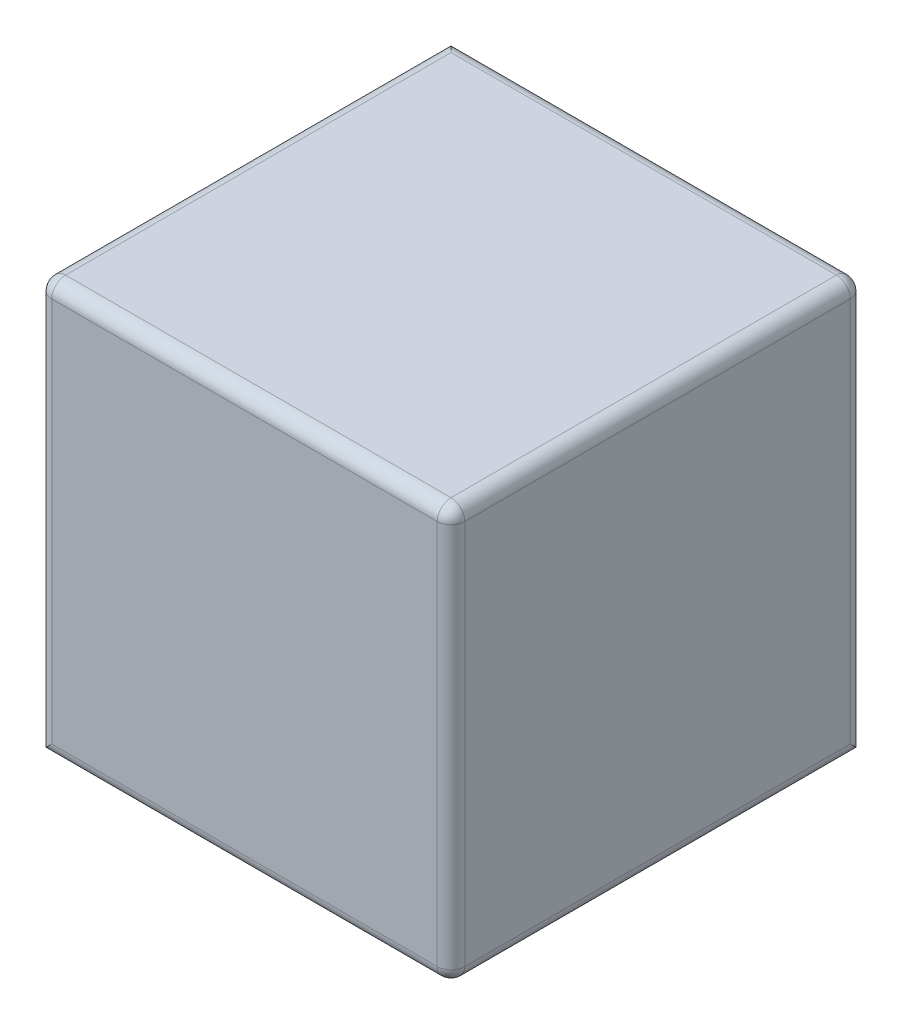
ISO-10303-21;
HEADER;
FILE_DESCRIPTION(('STEP AP214'),'2;1');
FILE_NAME('part.step','',(''),(''),'','','');
FILE_SCHEMA(('AUTOMOTIVE_DESIGN { 1 0 10303 214 1 1 1 1 }'));
ENDSEC;
DATA;
#1=APPLICATION_CONTEXT('core data for automotive mechanical design processes');
#2=APPLICATION_PROTOCOL_DEFINITION('international standard','automotive_design',2000,#1);
#3=PRODUCT_CONTEXT('',#1,'mechanical');
#4=PRODUCT('Part','Part','',(#3));
#5=PRODUCT_RELATED_PRODUCT_CATEGORY('part','',(#4));
#6=PRODUCT_DEFINITION_FORMATION('','',#4);
#7=PRODUCT_DEFINITION_CONTEXT('part definition',#1,'design');
#8=PRODUCT_DEFINITION('design','',#6,#7);
#9=PRODUCT_DEFINITION_SHAPE('','',#8);
#10=(LENGTH_UNIT() NAMED_UNIT(*) SI_UNIT(.MILLI.,.METRE.));
#11=(NAMED_UNIT(*) PLANE_ANGLE_UNIT() SI_UNIT($,.RADIAN.));
#12=(NAMED_UNIT(*) SI_UNIT($,.STERADIAN.) SOLID_ANGLE_UNIT());
#13=UNCERTAINTY_MEASURE_WITH_UNIT(LENGTH_MEASURE(1.E-05),#10,'distance_accuracy_value','');
#14=(GEOMETRIC_REPRESENTATION_CONTEXT(3) GLOBAL_UNCERTAINTY_ASSIGNED_CONTEXT((#13)) GLOBAL_UNIT_ASSIGNED_CONTEXT((#10,
#11,#12)) REPRESENTATION_CONTEXT('',''));
#15=CARTESIAN_POINT('',(0.,0.,0.));
#16=DIRECTION('',(0.,0.,1.));
#17=DIRECTION('',(1.,0.,0.));
#18=AXIS2_PLACEMENT_3D('',#15,#16,#17);
#19=CARTESIAN_POINT('',(150.,-150.,300.));
#20=DIRECTION('',(-1.,0.,0.));
#21=DIRECTION('',(0.,0.,1.));
#22=AXIS2_PLACEMENT_3D('',#19,#20,#21);
#23=PLANE('',#22);
#24=DIRECTION('',(0.,1.,0.));
#25=VECTOR('',#24,1.);
#26=CARTESIAN_POINT('',(150.,-150.,290.));
#27=LINE('',#26,#25);
#28=CARTESIAN_POINT('',(150.,140.,290.));
#29=VERTEX_POINT('',#28);
#30=CARTESIAN_POINT('',(150.,-140.,290.));
#31=VERTEX_POINT('',#30);
#32=EDGE_CURVE('E139',#29,#31,#27,.F.);
#33=ORIENTED_EDGE('',*,*,#32,.T.);
#34=DIRECTION('',(0.,0.,-1.));
#35=VECTOR('',#34,1.);
#36=CARTESIAN_POINT('',(150.,-140.,300.));
#37=LINE('',#36,#35);
#38=CARTESIAN_POINT('',(150.,-140.,10.));
#39=VERTEX_POINT('',#38);
#40=EDGE_CURVE('E146',#31,#39,#37,.T.);
#41=ORIENTED_EDGE('',*,*,#40,.T.);
#42=DIRECTION('',(0.,1.,0.));
#43=VECTOR('',#42,1.);
#44=CARTESIAN_POINT('',(150.,150.,10.));
#45=LINE('',#44,#43);
#46=CARTESIAN_POINT('',(150.,140.,10.));
#47=VERTEX_POINT('',#46);
#48=EDGE_CURVE('E142',#39,#47,#45,.T.);
#49=ORIENTED_EDGE('',*,*,#48,.T.);
#50=DIRECTION('',(0.,0.,-1.));
#51=VECTOR('',#50,1.);
#52=CARTESIAN_POINT('',(150.,140.,300.));
#53=LINE('',#52,#51);
#54=EDGE_CURVE('E119',#47,#29,#53,.F.);
#55=ORIENTED_EDGE('',*,*,#54,.T.);
#56=EDGE_LOOP('',(#33,#41,#49,#55));
#57=FACE_BOUND('',#56,.T.);
#58=ADVANCED_FACE('F39',(#57),#23,.F.);
#59=CARTESIAN_POINT('',(-150.,150.,300.));
#60=DIRECTION('',(0.,-1.,0.));
#61=DIRECTION('',(0.,0.,-1.));
#62=AXIS2_PLACEMENT_3D('',#59,#60,#61);
#63=PLANE('',#62);
#64=DIRECTION('',(-1.,0.,0.));
#65=VECTOR('',#64,1.);
#66=CARTESIAN_POINT('',(-150.,150.,10.));
#67=LINE('',#66,#65);
#68=CARTESIAN_POINT('',(140.,150.,10.));
#69=VERTEX_POINT('',#68);
#70=CARTESIAN_POINT('',(-140.,150.,10.));
#71=VERTEX_POINT('',#70);
#72=EDGE_CURVE('E160',#69,#71,#67,.T.);
#73=ORIENTED_EDGE('',*,*,#72,.T.);
#74=DIRECTION('',(0.,0.,-1.));
#75=VECTOR('',#74,1.);
#76=CARTESIAN_POINT('',(-140.,150.,300.));
#77=LINE('',#76,#75);
#78=CARTESIAN_POINT('',(-140.,150.,290.));
#79=VERTEX_POINT('',#78);
#80=EDGE_CURVE('E164',#71,#79,#77,.F.);
#81=ORIENTED_EDGE('',*,*,#80,.T.);
#82=DIRECTION('',(-1.,0.,0.));
#83=VECTOR('',#82,1.);
#84=CARTESIAN_POINT('',(-150.,150.,290.));
#85=LINE('',#84,#83);
#86=CARTESIAN_POINT('',(140.,150.,290.));
#87=VERTEX_POINT('',#86);
#88=EDGE_CURVE('E157',#79,#87,#85,.F.);
#89=ORIENTED_EDGE('',*,*,#88,.T.);
#90=DIRECTION('',(0.,0.,-1.));
#91=VECTOR('',#90,1.);
#92=CARTESIAN_POINT('',(140.,150.,300.));
#93=LINE('',#92,#91);
#94=EDGE_CURVE('E154',#87,#69,#93,.T.);
#95=ORIENTED_EDGE('',*,*,#94,.T.);
#96=EDGE_LOOP('',(#73,#81,#89,#95));
#97=FACE_BOUND('',#96,.T.);
#98=ADVANCED_FACE('F291',(#97),#63,.F.);
#99=CARTESIAN_POINT('',(-150.,-150.,300.));
#100=DIRECTION('',(1.,0.,0.));
#101=DIRECTION('',(0.,0.,-1.));
#102=AXIS2_PLACEMENT_3D('',#99,#100,#101);
#103=PLANE('',#102);
#104=DIRECTION('',(0.,0.,-1.));
#105=VECTOR('',#104,1.);
#106=CARTESIAN_POINT('',(-150.,-150.,300.));
#107=LINE('',#106,#105);
#108=CARTESIAN_POINT('',(-150.,-150.,290.));
#109=VERTEX_POINT('',#108);
#110=CARTESIAN_POINT('',(-150.,-150.,0.));
#111=VERTEX_POINT('',#110);
#112=EDGE_CURVE('E113',#109,#111,#107,.T.);
#113=ORIENTED_EDGE('',*,*,#112,.F.);
#114=DIRECTION('',(0.,-1.,0.));
#115=VECTOR('',#114,1.);
#116=CARTESIAN_POINT('',(-150.,-150.,290.));
#117=LINE('',#116,#115);
#118=CARTESIAN_POINT('',(-150.,140.,290.));
#119=VERTEX_POINT('',#118);
#120=EDGE_CURVE('E63',#109,#119,#117,.F.);
#121=ORIENTED_EDGE('',*,*,#120,.T.);
#122=DIRECTION('',(0.,0.,-1.));
#123=VECTOR('',#122,1.);
#124=CARTESIAN_POINT('',(-150.,140.,300.));
#125=LINE('',#124,#123);
#126=CARTESIAN_POINT('',(-150.,140.,0.));
#127=VERTEX_POINT('',#126);
#128=EDGE_CURVE('E125',#119,#127,#125,.T.);
#129=ORIENTED_EDGE('',*,*,#128,.T.);
#130=DIRECTION('',(0.,-1.,0.));
#131=VECTOR('',#130,1.);
#132=CARTESIAN_POINT('',(-150.,-150.,0.));
#133=LINE('',#132,#131);
#134=EDGE_CURVE('E122',#127,#111,#133,.T.);
#135=ORIENTED_EDGE('',*,*,#134,.T.);
#136=EDGE_LOOP('',(#113,#121,#129,#135));
#137=FACE_BOUND('',#136,.T.);
#138=ADVANCED_FACE('F123',(#137),#103,.F.);
#139=CARTESIAN_POINT('',(-150.,-150.,300.));
#140=DIRECTION('',(0.,1.,0.));
#141=DIRECTION('',(0.,0.,1.));
#142=AXIS2_PLACEMENT_3D('',#139,#140,#141);
#143=PLANE('',#142);
#144=DIRECTION('',(0.,0.,-1.));
#145=VECTOR('',#144,1.);
#146=CARTESIAN_POINT('',(140.,-150.,300.));
#147=LINE('',#146,#145);
#148=CARTESIAN_POINT('',(140.,-150.,0.));
#149=VERTEX_POINT('',#148);
#150=CARTESIAN_POINT('',(140.,-150.,290.));
#151=VERTEX_POINT('',#150);
#152=EDGE_CURVE('E49',#149,#151,#147,.F.);
#153=ORIENTED_EDGE('',*,*,#152,.T.);
#154=DIRECTION('',(1.,0.,0.));
#155=VECTOR('',#154,1.);
#156=CARTESIAN_POINT('',(-150.,-150.,290.));
#157=LINE('',#156,#155);
#158=EDGE_CURVE('E11',#151,#109,#157,.F.);
#159=ORIENTED_EDGE('',*,*,#158,.T.);
#160=ORIENTED_EDGE('',*,*,#112,.T.);
#161=DIRECTION('',(1.,0.,0.));
#162=VECTOR('',#161,1.);
#163=CARTESIAN_POINT('',(-150.,-150.,0.));
#164=LINE('',#163,#162);
#165=EDGE_CURVE('E117',#111,#149,#164,.T.);
#166=ORIENTED_EDGE('',*,*,#165,.T.);
#167=EDGE_LOOP('',(#153,#159,#160,#166));
#168=FACE_BOUND('',#167,.T.);
#169=ADVANCED_FACE('F115',(#168),#143,.F.);
#170=CARTESIAN_POINT('',(0.,0.,300.));
#171=DIRECTION('',(0.,0.,-1.));
#172=DIRECTION('',(-1.,0.,0.));
#173=AXIS2_PLACEMENT_3D('',#170,#171,#172);
#174=PLANE('',#173);
#175=DIRECTION('',(1.,0.,0.));
#176=VECTOR('',#175,1.);
#177=CARTESIAN_POINT('',(0.,-140.,300.));
#178=LINE('',#177,#176);
#179=CARTESIAN_POINT('',(-140.,-140.,300.));
#180=VERTEX_POINT('',#179);
#181=CARTESIAN_POINT('',(140.,-140.,300.));
#182=VERTEX_POINT('',#181);
#183=EDGE_CURVE('E167',#180,#182,#178,.T.);
#184=ORIENTED_EDGE('',*,*,#183,.T.);
#185=DIRECTION('',(0.,1.,0.));
#186=VECTOR('',#185,1.);
#187=CARTESIAN_POINT('',(140.,0.,300.));
#188=LINE('',#187,#186);
#189=CARTESIAN_POINT('',(140.,140.,300.));
#190=VERTEX_POINT('',#189);
#191=EDGE_CURVE('E176',#182,#190,#188,.T.);
#192=ORIENTED_EDGE('',*,*,#191,.T.);
#193=DIRECTION('',(-1.,0.,0.));
#194=VECTOR('',#193,1.);
#195=CARTESIAN_POINT('',(0.,140.,300.));
#196=LINE('',#195,#194);
#197=CARTESIAN_POINT('',(-140.,140.,300.));
#198=VERTEX_POINT('',#197);
#199=EDGE_CURVE('E173',#190,#198,#196,.T.);
#200=ORIENTED_EDGE('',*,*,#199,.T.);
#201=DIRECTION('',(0.,-1.,0.));
#202=VECTOR('',#201,1.);
#203=CARTESIAN_POINT('',(-140.,0.,300.));
#204=LINE('',#203,#202);
#205=EDGE_CURVE('E170',#198,#180,#204,.T.);
#206=ORIENTED_EDGE('',*,*,#205,.T.);
#207=EDGE_LOOP('',(#184,#192,#200,#206));
#208=FACE_BOUND('',#207,.T.);
#209=ADVANCED_FACE('F283',(#208),#174,.F.);
#210=CARTESIAN_POINT('',(0.,0.,0.));
#211=DIRECTION('',(0.,0.,-1.));
#212=DIRECTION('',(-1.,0.,0.));
#213=AXIS2_PLACEMENT_3D('',#210,#211,#212);
#214=PLANE('',#213);
#215=DIRECTION('',(-1.,0.,0.));
#216=VECTOR('',#215,1.);
#217=CARTESIAN_POINT('',(150.,140.,0.));
#218=LINE('',#217,#216);
#219=CARTESIAN_POINT('',(140.,140.,0.));
#220=VERTEX_POINT('',#219);
#221=EDGE_CURVE('E149',#127,#220,#218,.F.);
#222=ORIENTED_EDGE('',*,*,#221,.T.);
#223=DIRECTION('',(0.,1.,0.));
#224=VECTOR('',#223,1.);
#225=CARTESIAN_POINT('',(140.,-150.,0.));
#226=LINE('',#225,#224);
#227=EDGE_CURVE('E133',#220,#149,#226,.F.);
#228=ORIENTED_EDGE('',*,*,#227,.T.);
#229=ORIENTED_EDGE('',*,*,#165,.F.);
#230=ORIENTED_EDGE('',*,*,#134,.F.);
#231=EDGE_LOOP('',(#222,#228,#229,#230));
#232=FACE_BOUND('',#231,.T.);
#233=ADVANCED_FACE('F131',(#232),#214,.T.);
#234=CARTESIAN_POINT('',(-140.,0.,290.));
#235=DIRECTION('',(0.,-1.,0.));
#236=DIRECTION('',(0.,0.,-1.));
#237=AXIS2_PLACEMENT_3D('',#234,#235,#236);
#238=CYLINDRICAL_SURFACE('',#237,10.);
#239=CARTESIAN_POINT('',(-140.,-140.,290.));
#240=DIRECTION('',(0.707106781186547,-0.707106781186547,0.));
#241=DIRECTION('',(0.707106781186547,0.707106781186547,0.));
#242=AXIS2_PLACEMENT_3D('',#239,#240,#241);
#243=ELLIPSE('',#242,14.1421356237309,10.);
#244=EDGE_CURVE('E230',#180,#109,#243,.T.);
#245=ORIENTED_EDGE('',*,*,#244,.F.);
#246=ORIENTED_EDGE('',*,*,#205,.F.);
#247=CARTESIAN_POINT('',(-140.,140.,290.));
#248=DIRECTION('',(0.,1.,0.));
#249=DIRECTION('',(0.,0.,1.));
#250=AXIS2_PLACEMENT_3D('',#247,#248,#249);
#251=CIRCLE('',#250,10.);
#252=EDGE_CURVE('E233',#119,#198,#251,.T.);
#253=ORIENTED_EDGE('',*,*,#252,.F.);
#254=ORIENTED_EDGE('',*,*,#120,.F.);
#255=EDGE_LOOP('',(#245,#246,#253,#254));
#256=FACE_BOUND('',#255,.T.);
#257=ADVANCED_FACE('F41',(#256),#238,.T.);
#258=CARTESIAN_POINT('',(0.,140.,290.));
#259=DIRECTION('',(-1.,0.,0.));
#260=DIRECTION('',(0.,0.,1.));
#261=AXIS2_PLACEMENT_3D('',#258,#259,#260);
#262=CYLINDRICAL_SURFACE('',#261,10.);
#263=CARTESIAN_POINT('',(-140.,140.,290.));
#264=DIRECTION('',(-1.,0.,0.));
#265=DIRECTION('',(0.,0.,1.));
#266=AXIS2_PLACEMENT_3D('',#263,#264,#265);
#267=CIRCLE('',#266,10.);
#268=EDGE_CURVE('E43',#198,#79,#267,.T.);
#269=ORIENTED_EDGE('',*,*,#268,.F.);
#270=ORIENTED_EDGE('',*,*,#199,.F.);
#271=CARTESIAN_POINT('',(140.,140.,290.));
#272=DIRECTION('',(1.,0.,0.));
#273=DIRECTION('',(0.,0.,-1.));
#274=AXIS2_PLACEMENT_3D('',#271,#272,#273);
#275=CIRCLE('',#274,10.);
#276=EDGE_CURVE('E223',#87,#190,#275,.T.);
#277=ORIENTED_EDGE('',*,*,#276,.F.);
#278=ORIENTED_EDGE('',*,*,#88,.F.);
#279=EDGE_LOOP('',(#269,#270,#277,#278));
#280=FACE_BOUND('',#279,.T.);
#281=ADVANCED_FACE('F286',(#280),#262,.T.);
#282=CARTESIAN_POINT('',(-140.,140.,290.));
#283=DIRECTION('',(0.,0.,1.));
#284=DIRECTION('',(1.,0.,0.));
#285=AXIS2_PLACEMENT_3D('',#282,#283,#284);
#286=SPHERICAL_SURFACE('',#285,10.);
#287=ORIENTED_EDGE('',*,*,#252,.T.);
#288=ORIENTED_EDGE('',*,*,#268,.T.);
#289=CARTESIAN_POINT('',(-140.,140.,290.));
#290=DIRECTION('',(0.,0.,1.));
#291=DIRECTION('',(1.,0.,0.));
#292=AXIS2_PLACEMENT_3D('',#289,#290,#291);
#293=CIRCLE('',#292,10.);
#294=EDGE_CURVE('E219',#119,#79,#293,.F.);
#295=ORIENTED_EDGE('',*,*,#294,.F.);
#296=EDGE_LOOP('',(#287,#288,#295));
#297=FACE_BOUND('',#296,.T.);
#298=ADVANCED_FACE('F241',(#297),#286,.T.);
#299=CARTESIAN_POINT('',(0.,-140.,290.));
#300=DIRECTION('',(1.,0.,0.));
#301=DIRECTION('',(0.,0.,-1.));
#302=AXIS2_PLACEMENT_3D('',#299,#300,#301);
#303=CYLINDRICAL_SURFACE('',#302,10.);
#304=ORIENTED_EDGE('',*,*,#244,.T.);
#305=ORIENTED_EDGE('',*,*,#158,.F.);
#306=CARTESIAN_POINT('',(140.,-140.,290.));
#307=DIRECTION('',(1.,0.,0.));
#308=DIRECTION('',(0.,0.,-1.));
#309=AXIS2_PLACEMENT_3D('',#306,#307,#308);
#310=CIRCLE('',#309,10.);
#311=EDGE_CURVE('E215',#182,#151,#310,.T.);
#312=ORIENTED_EDGE('',*,*,#311,.F.);
#313=ORIENTED_EDGE('',*,*,#183,.F.);
#314=EDGE_LOOP('',(#304,#305,#312,#313));
#315=FACE_BOUND('',#314,.T.);
#316=ADVANCED_FACE('F278',(#315),#303,.T.);
#317=CARTESIAN_POINT('',(140.,0.,290.));
#318=DIRECTION('',(0.,1.,0.));
#319=DIRECTION('',(0.,0.,1.));
#320=AXIS2_PLACEMENT_3D('',#317,#318,#319);
#321=CYLINDRICAL_SURFACE('',#320,10.);
#322=CARTESIAN_POINT('',(140.,140.,290.));
#323=DIRECTION('',(0.,1.,0.));
#324=DIRECTION('',(0.,0.,1.));
#325=AXIS2_PLACEMENT_3D('',#322,#323,#324);
#326=CIRCLE('',#325,10.);
#327=EDGE_CURVE('E226',#190,#29,#326,.T.);
#328=ORIENTED_EDGE('',*,*,#327,.F.);
#329=ORIENTED_EDGE('',*,*,#191,.F.);
#330=CARTESIAN_POINT('',(140.,-140.,290.));
#331=DIRECTION('',(0.,-1.,0.));
#332=DIRECTION('',(0.,0.,-1.));
#333=AXIS2_PLACEMENT_3D('',#330,#331,#332);
#334=CIRCLE('',#333,10.);
#335=EDGE_CURVE('E211',#31,#182,#334,.T.);
#336=ORIENTED_EDGE('',*,*,#335,.F.);
#337=ORIENTED_EDGE('',*,*,#32,.F.);
#338=EDGE_LOOP('',(#328,#329,#336,#337));
#339=FACE_BOUND('',#338,.T.);
#340=ADVANCED_FACE('F318',(#339),#321,.T.);
#341=CARTESIAN_POINT('',(140.,140.,290.));
#342=DIRECTION('',(0.,0.,1.));
#343=DIRECTION('',(1.,0.,0.));
#344=AXIS2_PLACEMENT_3D('',#341,#342,#343);
#345=SPHERICAL_SURFACE('',#344,10.);
#346=ORIENTED_EDGE('',*,*,#276,.T.);
#347=ORIENTED_EDGE('',*,*,#327,.T.);
#348=CARTESIAN_POINT('',(140.,140.,290.));
#349=DIRECTION('',(0.,0.,1.));
#350=DIRECTION('',(1.,0.,0.));
#351=AXIS2_PLACEMENT_3D('',#348,#349,#350);
#352=CIRCLE('',#351,10.);
#353=EDGE_CURVE('E207',#87,#29,#352,.F.);
#354=ORIENTED_EDGE('',*,*,#353,.F.);
#355=EDGE_LOOP('',(#346,#347,#354));
#356=FACE_BOUND('',#355,.T.);
#357=ADVANCED_FACE('F289',(#356),#345,.T.);
#358=CARTESIAN_POINT('',(-140.,140.,300.));
#359=DIRECTION('',(0.,0.,-1.));
#360=DIRECTION('',(-1.,0.,0.));
#361=AXIS2_PLACEMENT_3D('',#358,#359,#360);
#362=CYLINDRICAL_SURFACE('',#361,10.);
#363=ORIENTED_EDGE('',*,*,#294,.T.);
#364=ORIENTED_EDGE('',*,*,#80,.F.);
#365=CARTESIAN_POINT('',(-140.,140.,10.));
#366=DIRECTION('',(0.707106781186547,0.,-0.707106781186547));
#367=DIRECTION('',(-0.707106781186547,0.,-0.707106781186547));
#368=AXIS2_PLACEMENT_3D('',#365,#366,#367);
#369=ELLIPSE('',#368,14.1421356237309,10.);
#370=EDGE_CURVE('E204',#127,#71,#369,.T.);
#371=ORIENTED_EDGE('',*,*,#370,.F.);
#372=ORIENTED_EDGE('',*,*,#128,.F.);
#373=EDGE_LOOP('',(#363,#364,#371,#372));
#374=FACE_BOUND('',#373,.T.);
#375=ADVANCED_FACE('F247',(#374),#362,.T.);
#376=CARTESIAN_POINT('',(140.,-140.,290.));
#377=DIRECTION('',(0.,0.,1.));
#378=DIRECTION('',(1.,0.,0.));
#379=AXIS2_PLACEMENT_3D('',#376,#377,#378);
#380=SPHERICAL_SURFACE('',#379,10.);
#381=ORIENTED_EDGE('',*,*,#335,.T.);
#382=ORIENTED_EDGE('',*,*,#311,.T.);
#383=CARTESIAN_POINT('',(140.,-140.,290.));
#384=DIRECTION('',(0.,0.,1.));
#385=DIRECTION('',(1.,0.,0.));
#386=AXIS2_PLACEMENT_3D('',#383,#384,#385);
#387=CIRCLE('',#386,10.);
#388=EDGE_CURVE('E200',#31,#151,#387,.F.);
#389=ORIENTED_EDGE('',*,*,#388,.F.);
#390=EDGE_LOOP('',(#381,#382,#389));
#391=FACE_BOUND('',#390,.T.);
#392=ADVANCED_FACE('F274',(#391),#380,.T.);
#393=CARTESIAN_POINT('',(140.,140.,300.));
#394=DIRECTION('',(0.,0.,-1.));
#395=DIRECTION('',(-1.,0.,0.));
#396=AXIS2_PLACEMENT_3D('',#393,#394,#395);
#397=CYLINDRICAL_SURFACE('',#396,10.);
#398=ORIENTED_EDGE('',*,*,#353,.T.);
#399=ORIENTED_EDGE('',*,*,#54,.F.);
#400=CARTESIAN_POINT('',(140.,140.,10.));
#401=DIRECTION('',(0.,0.,-1.));
#402=DIRECTION('',(-1.,0.,0.));
#403=AXIS2_PLACEMENT_3D('',#400,#401,#402);
#404=CIRCLE('',#403,10.);
#405=EDGE_CURVE('E196',#69,#47,#404,.T.);
#406=ORIENTED_EDGE('',*,*,#405,.F.);
#407=ORIENTED_EDGE('',*,*,#94,.F.);
#408=EDGE_LOOP('',(#398,#399,#406,#407));
#409=FACE_BOUND('',#408,.T.);
#410=ADVANCED_FACE('F264',(#409),#397,.T.);
#411=CARTESIAN_POINT('',(-150.,140.,10.));
#412=DIRECTION('',(1.,0.,0.));
#413=DIRECTION('',(0.,0.,-1.));
#414=AXIS2_PLACEMENT_3D('',#411,#412,#413);
#415=CYLINDRICAL_SURFACE('',#414,10.);
#416=ORIENTED_EDGE('',*,*,#370,.T.);
#417=ORIENTED_EDGE('',*,*,#72,.F.);
#418=CARTESIAN_POINT('',(140.,140.,10.));
#419=DIRECTION('',(1.,0.,0.));
#420=DIRECTION('',(0.,0.,-1.));
#421=AXIS2_PLACEMENT_3D('',#418,#419,#420);
#422=CIRCLE('',#421,10.);
#423=EDGE_CURVE('E192',#220,#69,#422,.T.);
#424=ORIENTED_EDGE('',*,*,#423,.F.);
#425=ORIENTED_EDGE('',*,*,#221,.F.);
#426=EDGE_LOOP('',(#416,#417,#424,#425));
#427=FACE_BOUND('',#426,.T.);
#428=ADVANCED_FACE('F252',(#427),#415,.T.);
#429=CARTESIAN_POINT('',(140.,-140.,300.));
#430=DIRECTION('',(0.,0.,-1.));
#431=DIRECTION('',(-1.,0.,0.));
#432=AXIS2_PLACEMENT_3D('',#429,#430,#431);
#433=CYLINDRICAL_SURFACE('',#432,10.);
#434=ORIENTED_EDGE('',*,*,#388,.T.);
#435=ORIENTED_EDGE('',*,*,#152,.F.);
#436=CARTESIAN_POINT('',(140.,-140.,10.));
#437=DIRECTION('',(0.,0.707106781186547,-0.707106781186547));
#438=DIRECTION('',(0.,-0.707106781186547,-0.707106781186547));
#439=AXIS2_PLACEMENT_3D('',#436,#437,#438);
#440=ELLIPSE('',#439,14.1421356237309,10.);
#441=EDGE_CURVE('E189',#39,#149,#440,.T.);
#442=ORIENTED_EDGE('',*,*,#441,.F.);
#443=ORIENTED_EDGE('',*,*,#40,.F.);
#444=EDGE_LOOP('',(#434,#435,#442,#443));
#445=FACE_BOUND('',#444,.T.);
#446=ADVANCED_FACE('F271',(#445),#433,.T.);
#447=CARTESIAN_POINT('',(140.,140.,10.));
#448=DIRECTION('',(0.,0.,1.));
#449=DIRECTION('',(1.,0.,0.));
#450=AXIS2_PLACEMENT_3D('',#447,#448,#449);
#451=SPHERICAL_SURFACE('',#450,10.);
#452=ORIENTED_EDGE('',*,*,#423,.T.);
#453=ORIENTED_EDGE('',*,*,#405,.T.);
#454=CARTESIAN_POINT('',(140.,140.,10.));
#455=DIRECTION('',(0.,1.,0.));
#456=DIRECTION('',(0.,0.,1.));
#457=AXIS2_PLACEMENT_3D('',#454,#455,#456);
#458=CIRCLE('',#457,10.);
#459=EDGE_CURVE('E186',#220,#47,#458,.F.);
#460=ORIENTED_EDGE('',*,*,#459,.F.);
#461=EDGE_LOOP('',(#452,#453,#460));
#462=FACE_BOUND('',#461,.T.);
#463=ADVANCED_FACE('F260',(#462),#451,.T.);
#464=CARTESIAN_POINT('',(140.,-150.,10.));
#465=DIRECTION('',(0.,-1.,0.));
#466=DIRECTION('',(0.,0.,-1.));
#467=AXIS2_PLACEMENT_3D('',#464,#465,#466);
#468=CYLINDRICAL_SURFACE('',#467,10.);
#469=ORIENTED_EDGE('',*,*,#441,.T.);
#470=ORIENTED_EDGE('',*,*,#227,.F.);
#471=ORIENTED_EDGE('',*,*,#459,.T.);
#472=ORIENTED_EDGE('',*,*,#48,.F.);
#473=EDGE_LOOP('',(#469,#470,#471,#472));
#474=FACE_BOUND('',#473,.T.);
#475=ADVANCED_FACE('F257',(#474),#468,.T.);
#476=CLOSED_SHELL('',(#58,#98,#138,#169,#209,#233,#257,#281,#298,#316,#340,#357,#375,#392,#410,
#428,#446,#463,#475));
#477=MANIFOLD_SOLID_BREP('B2',#476);
#478=ADVANCED_BREP_SHAPE_REPRESENTATION('',(#18,#477),#14);
#479=SHAPE_DEFINITION_REPRESENTATION(#9,#478);
ENDSEC;
END-ISO-10303-21;
